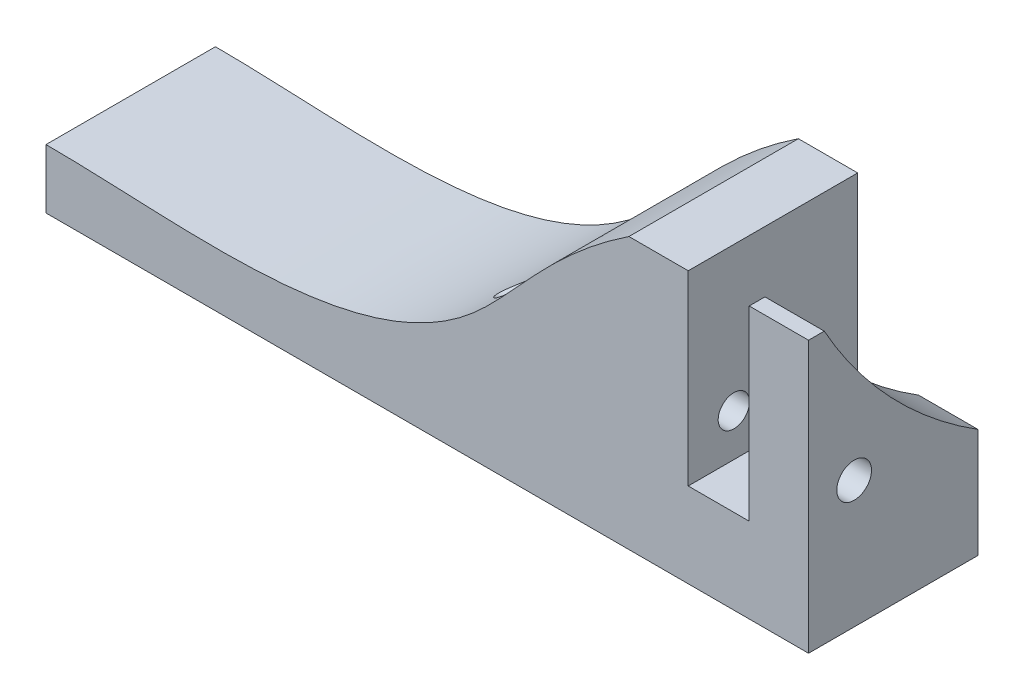
ISO-10303-21;
HEADER;
FILE_DESCRIPTION(('STEP AP214'),'2;1');
FILE_NAME('part.step','',(''),(''),'','','');
FILE_SCHEMA(('AUTOMOTIVE_DESIGN { 1 0 10303 214 1 1 1 1 }'));
ENDSEC;
DATA;
#1=APPLICATION_CONTEXT('core data for automotive mechanical design processes');
#2=APPLICATION_PROTOCOL_DEFINITION('international standard','automotive_design',2000,#1);
#3=PRODUCT_CONTEXT('',#1,'mechanical');
#4=PRODUCT('Part','Part','',(#3));
#5=PRODUCT_RELATED_PRODUCT_CATEGORY('part','',(#4));
#6=PRODUCT_DEFINITION_FORMATION('','',#4);
#7=PRODUCT_DEFINITION_CONTEXT('part definition',#1,'design');
#8=PRODUCT_DEFINITION('design','',#6,#7);
#9=PRODUCT_DEFINITION_SHAPE('','',#8);
#10=(LENGTH_UNIT() NAMED_UNIT(*) SI_UNIT(.MILLI.,.METRE.));
#11=(NAMED_UNIT(*) PLANE_ANGLE_UNIT() SI_UNIT($,.RADIAN.));
#12=(NAMED_UNIT(*) SI_UNIT($,.STERADIAN.) SOLID_ANGLE_UNIT());
#13=UNCERTAINTY_MEASURE_WITH_UNIT(LENGTH_MEASURE(1.E-05),#10,'distance_accuracy_value','');
#14=(GEOMETRIC_REPRESENTATION_CONTEXT(3) GLOBAL_UNCERTAINTY_ASSIGNED_CONTEXT((#13)) GLOBAL_UNIT_ASSIGNED_CONTEXT((#10,
#11,#12)) REPRESENTATION_CONTEXT('',''));
#15=CARTESIAN_POINT('',(0.,0.,0.));
#16=DIRECTION('',(0.,0.,1.));
#17=DIRECTION('',(1.,0.,0.));
#18=AXIS2_PLACEMENT_3D('',#15,#16,#17);
#19=CARTESIAN_POINT('',(7.,130.395512054749,20.));
#20=DIRECTION('',(0.,-1.,0.));
#21=DIRECTION('',(0.,0.,-1.));
#22=AXIS2_PLACEMENT_3D('',#19,#20,#21);
#23=PLANE('',#22);
#24=DIRECTION('',(0.,0.,-1.));
#25=VECTOR('',#24,1.);
#26=CARTESIAN_POINT('',(7.,130.395512054749,20.));
#27=LINE('',#26,#25);
#28=CARTESIAN_POINT('',(7.,130.395512054749,20.));
#29=VERTEX_POINT('',#28);
#30=CARTESIAN_POINT('',(7.,130.395512054749,18.1433906819151));
#31=VERTEX_POINT('',#30);
#32=EDGE_CURVE('E155',#29,#31,#27,.T.);
#33=ORIENTED_EDGE('',*,*,#32,.T.);
#34=DIRECTION('',(1.,0.,0.));
#35=VECTOR('',#34,1.);
#36=CARTESIAN_POINT('',(-157.106637611548,130.395512054749,18.1433906819151));
#37=LINE('',#36,#35);
#38=CARTESIAN_POINT('',(0.,130.395512054749,18.1433906819151));
#39=VERTEX_POINT('',#38);
#40=EDGE_CURVE('E223',#31,#39,#37,.F.);
#41=ORIENTED_EDGE('',*,*,#40,.T.);
#42=DIRECTION('',(0.,0.,-1.));
#43=VECTOR('',#42,1.);
#44=CARTESIAN_POINT('',(0.,130.395512054749,20.));
#45=LINE('',#44,#43);
#46=CARTESIAN_POINT('',(0.,130.395512054749,20.));
#47=VERTEX_POINT('',#46);
#48=EDGE_CURVE('E58',#47,#39,#45,.T.);
#49=ORIENTED_EDGE('',*,*,#48,.F.);
#50=DIRECTION('',(-1.,0.,0.));
#51=VECTOR('',#50,1.);
#52=CARTESIAN_POINT('',(7.,130.395512054749,20.));
#53=LINE('',#52,#51);
#54=EDGE_CURVE('E189',#29,#47,#53,.T.);
#55=ORIENTED_EDGE('',*,*,#54,.F.);
#56=EDGE_LOOP('',(#33,#41,#49,#55));
#57=FACE_BOUND('',#56,.T.);
#58=ADVANCED_FACE('F44',(#57),#23,.F.);
#59=CARTESIAN_POINT('',(0.,130.395512054749,20.));
#60=DIRECTION('',(1.,0.,0.));
#61=DIRECTION('',(0.,1.,0.));
#62=AXIS2_PLACEMENT_3D('',#59,#60,#61);
#63=PLANE('',#62);
#64=CARTESIAN_POINT('',(0.,113.395512054749,14.6157527669362));
#65=DIRECTION('',(1.,0.,0.));
#66=DIRECTION('',(0.,1.,0.));
#67=AXIS2_PLACEMENT_3D('',#64,#65,#66);
#68=CIRCLE('',#67,2.05);
#69=CARTESIAN_POINT('',(0.,115.445512054749,14.6157527669362));
#70=VERTEX_POINT('',#69);
#71=EDGE_CURVE('E163',#70,#70,#68,.T.);
#72=ORIENTED_EDGE('',*,*,#71,.T.);
#73=EDGE_LOOP('',(#72));
#74=FACE_BOUND('',#73,.T.);
#75=ORIENTED_EDGE('',*,*,#48,.T.);
#76=CARTESIAN_POINT('',(0.,156.175472316535,-28.1642074948499));
#77=DIRECTION('',(1.,0.,0.));
#78=DIRECTION('',(0.,1.,0.));
#79=AXIS2_PLACEMENT_3D('',#76,#77,#78);
#80=CIRCLE('',#79,53.);
#81=CARTESIAN_POINT('',(0.,111.27806241143,0.));
#82=VERTEX_POINT('',#81);
#83=EDGE_CURVE('E218',#39,#82,#80,.T.);
#84=ORIENTED_EDGE('',*,*,#83,.T.);
#85=DIRECTION('',(0.,-1.,0.));
#86=VECTOR('',#85,1.);
#87=CARTESIAN_POINT('',(0.,130.395512054749,0.));
#88=LINE('',#87,#86);
#89=CARTESIAN_POINT('',(0.,108.395512054749,0.));
#90=VERTEX_POINT('',#89);
#91=EDGE_CURVE('E159',#82,#90,#88,.T.);
#92=ORIENTED_EDGE('',*,*,#91,.T.);
#93=DIRECTION('',(0.,0.,-1.));
#94=VECTOR('',#93,1.);
#95=CARTESIAN_POINT('',(0.,108.395512054749,20.));
#96=LINE('',#95,#94);
#97=CARTESIAN_POINT('',(0.,108.395512054749,20.));
#98=VERTEX_POINT('',#97);
#99=EDGE_CURVE('E208',#98,#90,#96,.T.);
#100=ORIENTED_EDGE('',*,*,#99,.F.);
#101=DIRECTION('',(0.,-1.,0.));
#102=VECTOR('',#101,1.);
#103=CARTESIAN_POINT('',(0.,130.395512054749,20.));
#104=LINE('',#103,#102);
#105=EDGE_CURVE('E113',#47,#98,#104,.T.);
#106=ORIENTED_EDGE('',*,*,#105,.F.);
#107=EDGE_LOOP('',(#75,#84,#92,#100,#106));
#108=FACE_BOUND('',#107,.T.);
#109=ADVANCED_FACE('F215',(#74,#108),#63,.F.);
#110=CARTESIAN_POINT('',(0.,108.395512054749,20.));
#111=DIRECTION('',(0.,-1.,0.));
#112=DIRECTION('',(0.,0.,-1.));
#113=AXIS2_PLACEMENT_3D('',#110,#111,#112);
#114=PLANE('',#113);
#115=DIRECTION('',(-1.,0.,0.));
#116=VECTOR('',#115,1.);
#117=CARTESIAN_POINT('',(0.,108.395512054749,0.));
#118=LINE('',#117,#116);
#119=CARTESIAN_POINT('',(-7.2,108.395512054749,0.));
#120=VERTEX_POINT('',#119);
#121=EDGE_CURVE('E162',#90,#120,#118,.T.);
#122=ORIENTED_EDGE('',*,*,#121,.T.);
#123=DIRECTION('',(0.,0.,-1.));
#124=VECTOR('',#123,1.);
#125=CARTESIAN_POINT('',(-7.2,108.395512054749,20.));
#126=LINE('',#125,#124);
#127=CARTESIAN_POINT('',(-7.2,108.395512054749,20.));
#128=VERTEX_POINT('',#127);
#129=EDGE_CURVE('E204',#128,#120,#126,.T.);
#130=ORIENTED_EDGE('',*,*,#129,.F.);
#131=DIRECTION('',(-1.,0.,0.));
#132=VECTOR('',#131,1.);
#133=CARTESIAN_POINT('',(0.,108.395512054749,20.));
#134=LINE('',#133,#132);
#135=EDGE_CURVE('E238',#98,#128,#134,.T.);
#136=ORIENTED_EDGE('',*,*,#135,.F.);
#137=ORIENTED_EDGE('',*,*,#99,.T.);
#138=EDGE_LOOP('',(#122,#130,#136,#137));
#139=FACE_BOUND('',#138,.T.);
#140=ADVANCED_FACE('F267',(#139),#114,.F.);
#141=CARTESIAN_POINT('',(-7.2,108.395512054749,20.));
#142=DIRECTION('',(-1.,0.,0.));
#143=DIRECTION('',(0.,-1.,0.));
#144=AXIS2_PLACEMENT_3D('',#141,#142,#143);
#145=PLANE('',#144);
#146=CARTESIAN_POINT('',(-7.2,113.395512054749,14.6157527669362));
#147=DIRECTION('',(-1.,0.,0.));
#148=DIRECTION('',(0.,-1.,0.));
#149=AXIS2_PLACEMENT_3D('',#146,#147,#148);
#150=CIRCLE('',#149,1.85);
#151=CARTESIAN_POINT('',(-7.2,111.545512054749,14.6157527669362));
#152=VERTEX_POINT('',#151);
#153=EDGE_CURVE('E403',#152,#152,#150,.T.);
#154=ORIENTED_EDGE('',*,*,#153,.T.);
#155=EDGE_LOOP('',(#154));
#156=FACE_BOUND('',#155,.T.);
#157=DIRECTION('',(0.,1.,0.));
#158=VECTOR('',#157,1.);
#159=CARTESIAN_POINT('',(-7.2,108.395512054749,0.));
#160=LINE('',#159,#158);
#161=CARTESIAN_POINT('',(-7.2,130.395512054749,0.));
#162=VERTEX_POINT('',#161);
#163=EDGE_CURVE('E166',#120,#162,#160,.T.);
#164=ORIENTED_EDGE('',*,*,#163,.T.);
#165=DIRECTION('',(0.,0.,-1.));
#166=VECTOR('',#165,1.);
#167=CARTESIAN_POINT('',(-7.2,130.395512054749,20.));
#168=LINE('',#167,#166);
#169=CARTESIAN_POINT('',(-7.2,130.395512054749,20.));
#170=VERTEX_POINT('',#169);
#171=EDGE_CURVE('E201',#170,#162,#168,.T.);
#172=ORIENTED_EDGE('',*,*,#171,.F.);
#173=DIRECTION('',(0.,1.,0.));
#174=VECTOR('',#173,1.);
#175=CARTESIAN_POINT('',(-7.2,108.395512054749,20.));
#176=LINE('',#175,#174);
#177=EDGE_CURVE('E241',#128,#170,#176,.T.);
#178=ORIENTED_EDGE('',*,*,#177,.F.);
#179=ORIENTED_EDGE('',*,*,#129,.T.);
#180=EDGE_LOOP('',(#164,#172,#178,#179));
#181=FACE_BOUND('',#180,.T.);
#182=ADVANCED_FACE('F263',(#156,#181),#145,.F.);
#183=CARTESIAN_POINT('',(-7.2,130.395512054749,20.));
#184=DIRECTION('',(0.,-1.,0.));
#185=DIRECTION('',(0.,0.,-1.));
#186=AXIS2_PLACEMENT_3D('',#183,#184,#185);
#187=PLANE('',#186);
#188=DIRECTION('',(-1.,0.,0.));
#189=VECTOR('',#188,1.);
#190=CARTESIAN_POINT('',(-7.2,130.395512054749,0.));
#191=LINE('',#190,#189);
#192=CARTESIAN_POINT('',(-14.2,130.395512054749,0.));
#193=VERTEX_POINT('',#192);
#194=EDGE_CURVE('E170',#162,#193,#191,.T.);
#195=ORIENTED_EDGE('',*,*,#194,.T.);
#196=DIRECTION('',(0.,0.,-1.));
#197=VECTOR('',#196,1.);
#198=CARTESIAN_POINT('',(-14.2,130.395512054749,20.));
#199=LINE('',#198,#197);
#200=CARTESIAN_POINT('',(-14.2,130.395512054749,20.));
#201=VERTEX_POINT('',#200);
#202=EDGE_CURVE('E197',#201,#193,#199,.T.);
#203=ORIENTED_EDGE('',*,*,#202,.F.);
#204=DIRECTION('',(-1.,0.,0.));
#205=VECTOR('',#204,1.);
#206=CARTESIAN_POINT('',(-7.2,130.395512054749,20.));
#207=LINE('',#206,#205);
#208=EDGE_CURVE('E244',#170,#201,#207,.T.);
#209=ORIENTED_EDGE('',*,*,#208,.F.);
#210=ORIENTED_EDGE('',*,*,#171,.T.);
#211=EDGE_LOOP('',(#195,#203,#209,#210));
#212=FACE_BOUND('',#211,.T.);
#213=ADVANCED_FACE('F258',(#212),#187,.F.);
#214=CARTESIAN_POINT('',(-14.2,130.395512054749,20.));
#215=CARTESIAN_POINT('',(-23.5305764736176,124.205565192291,20.));
#216=CARTESIAN_POINT('',(-38.4462109306657,100.318296320815,20.));
#217=CARTESIAN_POINT('',(-66.691471380597,105.395512054749,20.));
#218=CARTESIAN_POINT('',(-83.,105.395512054749,20.));
#219=B_SPLINE_CURVE_WITH_KNOTS('',3,(#214,#215,#216,#217,#218),.UNSPECIFIED.,.F.,.F.,(4,1,4),
(0.,0.267223525795242,1.),.UNSPECIFIED.);
#220=DIRECTION('',(0.,0.,-1.));
#221=VECTOR('',#220,1.);
#222=SURFACE_OF_LINEAR_EXTRUSION('',#219,#221);
#223=CARTESIAN_POINT('',(-32.5828166284044,113.395512054749,12.7657527669362));
#224=CARTESIAN_POINT('',(-32.4985640149264,113.468286739227,12.7657530324167));
#225=CARTESIAN_POINT('',(-32.4147235002987,113.541543087059,12.7700408927074));
#226=CARTESIAN_POINT('',(-32.2483380546385,113.688546064003,12.7876080992605));
#227=CARTESIAN_POINT('',(-32.1657937316529,113.762292901398,12.8008915436178));
#228=CARTESIAN_POINT('',(-32.0026262516761,113.909571085411,12.8369917075661));
#229=CARTESIAN_POINT('',(-31.9220026053751,113.983102482637,12.8598059710376));
#230=CARTESIAN_POINT('',(-31.7634305643206,114.129091067283,12.9156163298347));
#231=CARTESIAN_POINT('',(-31.6854803386932,114.201548969749,12.9486052958528));
#232=CARTESIAN_POINT('',(-31.5171858456044,114.359318813247,13.033601379416));
#233=CARTESIAN_POINT('',(-31.4276485897231,114.444158757142,13.0881403296101));
#234=CARTESIAN_POINT('',(-31.2561073400265,114.608133580243,13.2147706491924));
#235=CARTESIAN_POINT('',(-31.1740910813633,114.687277700838,13.2868327156862));
#236=CARTESIAN_POINT('',(-31.0381729692875,114.819371732612,13.4315078394184));
#237=CARTESIAN_POINT('',(-30.9820999937151,114.874205942849,13.5003392524457));
#238=CARTESIAN_POINT('',(-30.8786980996862,114.975778710841,13.6496378870481));
#239=CARTESIAN_POINT('',(-30.8313578375327,115.022527766119,13.7300897679214));
#240=CARTESIAN_POINT('',(-30.7567427815437,115.096452562343,13.8842917506133));
#241=CARTESIAN_POINT('',(-30.7273437663898,115.125676370606,13.9560233449377));
#242=CARTESIAN_POINT('',(-30.6773611159662,115.175451475547,14.1053660507991));
#243=CARTESIAN_POINT('',(-30.6567716631861,115.19600849532,14.1829732423269));
#244=CARTESIAN_POINT('',(-30.6256887699413,115.227070461522,14.3427152016263));
#245=CARTESIAN_POINT('',(-30.6152604930996,115.237510525606,14.4248756666595));
#246=CARTESIAN_POINT('',(-30.6055852153507,115.247196027481,14.5905048727457));
#247=CARTESIAN_POINT('',(-30.6063338608478,115.246445824066,14.6739730917518));
#248=CARTESIAN_POINT('',(-30.6182744530019,115.234494249625,14.8306438454636));
#249=CARTESIAN_POINT('',(-30.6283830293563,115.224377075495,14.9040183830243));
#250=CARTESIAN_POINT('',(-30.6568606887188,115.195920544503,15.0474689468266));
#251=CARTESIAN_POINT('',(-30.6752307756257,115.1775801884,15.1175445710566));
#252=CARTESIAN_POINT('',(-30.7201133573436,115.132870821357,15.2557328219607));
#253=CARTESIAN_POINT('',(-30.7469259964388,115.106206232873,15.3236504216437));
#254=CARTESIAN_POINT('',(-30.8071223464249,115.046521101447,15.4534784293438));
#255=CARTESIAN_POINT('',(-30.8405096289031,115.013497104056,15.5153855448324));
#256=CARTESIAN_POINT('',(-30.9316585327252,114.923663699589,15.6637148975212));
#257=CARTESIAN_POINT('',(-30.9930026652562,114.863481063715,15.7459003576288));
#258=CARTESIAN_POINT('',(-31.1247942770541,114.735072864963,15.8955380691948));
#259=CARTESIAN_POINT('',(-31.1952681236189,114.666824058494,15.9629460619071));
#260=CARTESIAN_POINT('',(-31.3208846036183,114.546138382563,16.0658748603547));
#261=CARTESIAN_POINT('',(-31.3744164082689,114.494976856637,16.104936040425));
#262=CARTESIAN_POINT('',(-31.4839463132324,114.390926593609,16.1764023673778));
#263=CARTESIAN_POINT('',(-31.5399404033076,114.338040698783,16.2088178833331));
#264=CARTESIAN_POINT('',(-31.7111628426092,114.177381418533,16.2968601799497));
#265=CARTESIAN_POINT('',(-31.8295081211568,114.067725303319,16.3431855442484));
#266=CARTESIAN_POINT('',(-32.0324192530826,113.882526438757,16.4022304533743));
#267=CARTESIAN_POINT('',(-32.1156683403982,113.807302753097,16.4209608604363));
#268=CARTESIAN_POINT('',(-32.2838999691479,113.656943655255,16.4487821223974));
#269=CARTESIAN_POINT('',(-32.3688828824238,113.581808265742,16.4578708868924));
#270=CARTESIAN_POINT('',(-32.5401115790602,113.432179246946,16.4669106109181));
#271=CARTESIAN_POINT('',(-32.6263592159219,113.357686882149,16.4668464577678));
#272=CARTESIAN_POINT('',(-32.7994497803312,113.209928900907,16.4579081497255));
#273=CARTESIAN_POINT('',(-32.8862927425838,113.136663356852,16.4490334768044));
#274=CARTESIAN_POINT('',(-33.0616332473283,112.990452396412,16.4224208954894));
#275=CARTESIAN_POINT('',(-33.1501319849509,112.917537375931,16.4045237571738));
#276=CARTESIAN_POINT('',(-33.3266284764167,112.773819997787,16.3597898766731));
#277=CARTESIAN_POINT('',(-33.4146260991935,112.703018173987,16.3329508959676));
#278=CARTESIAN_POINT('',(-33.5892075606464,112.564166496862,16.2701882763153));
#279=CARTESIAN_POINT('',(-33.675794237751,112.496110562563,16.2342861529805));
#280=CARTESIAN_POINT('',(-33.8468116287397,112.363192584792,16.1529212247358));
#281=CARTESIAN_POINT('',(-33.9312437902163,112.298328368107,16.10746503946));
#282=CARTESIAN_POINT('',(-34.1018830402239,112.168641811441,16.003067855698));
#283=CARTESIAN_POINT('',(-34.1878852837692,112.104062399635,15.9434744118207));
#284=CARTESIAN_POINT('',(-34.3123210087662,112.011608333839,15.8443065281513));
#285=CARTESIAN_POINT('',(-34.3530365098944,111.981527459735,15.8096228011566));
#286=CARTESIAN_POINT('',(-34.4325304101025,111.923096279829,15.7367678064083));
#287=CARTESIAN_POINT('',(-34.4713090073414,111.89474579693,15.6985968965534));
#288=CARTESIAN_POINT('',(-34.5670282174108,111.825104364857,15.5965454916329));
#289=CARTESIAN_POINT('',(-34.6222910600421,111.785224768297,15.5300292111582));
#290=CARTESIAN_POINT('',(-34.6986002674376,111.73049902553,15.4231108980143));
#291=CARTESIAN_POINT('',(-34.7229223213166,111.713117932234,15.3863131119339));
#292=CARTESIAN_POINT('',(-34.7689694182138,111.680305635196,15.3102216243246));
#293=CARTESIAN_POINT('',(-34.7906913677065,111.664876752915,15.2709250332212));
#294=CARTESIAN_POINT('',(-34.839574650446,111.630240930263,15.1725917547669));
#295=CARTESIAN_POINT('',(-34.8651012886249,111.612231576894,15.112287551681));
#296=CARTESIAN_POINT('',(-34.9078931736787,111.582111783727,14.9874850153757));
#297=CARTESIAN_POINT('',(-34.9251742301647,111.569990054524,14.9229949798774));
#298=CARTESIAN_POINT('',(-34.9500231163229,111.552577533234,14.7906172925357));
#299=CARTESIAN_POINT('',(-34.9575055067619,111.547346824905,14.7227050477257));
#300=CARTESIAN_POINT('',(-34.9615886627975,111.544491034894,14.5863961928512));
#301=CARTESIAN_POINT('',(-34.9581929221721,111.546863511264,14.5179997453407));
#302=CARTESIAN_POINT('',(-34.9419548136361,111.558230408256,14.3910531508541));
#303=CARTESIAN_POINT('',(-34.9302468057987,111.566429764308,14.3322770059268));
#304=CARTESIAN_POINT('',(-34.89962433694,111.58793020555,14.2175585590987));
#305=CARTESIAN_POINT('',(-34.8807006062408,111.601237853253,14.1616200076845));
#306=CARTESIAN_POINT('',(-34.8429892816232,111.627845912938,14.0684759825845));
#307=CARTESIAN_POINT('',(-34.8256218241077,111.640123084744,14.0303804924349));
#308=CARTESIAN_POINT('',(-34.7882584938557,111.666605483563,13.9562617615967));
#309=CARTESIAN_POINT('',(-34.7682649902034,111.680808973123,13.9202366946949));
#310=CARTESIAN_POINT('',(-34.7048510387332,111.725992561554,13.8151058306247));
#311=CARTESIAN_POINT('',(-34.6580602531618,111.759501459879,13.749092705894));
#312=CARTESIAN_POINT('',(-34.5692032701337,111.823588774139,13.6386658645723));
#313=CARTESIAN_POINT('',(-34.5283336836863,111.853211408267,13.5926820084909));
#314=CARTESIAN_POINT('',(-34.4436759245531,111.91493007707,13.5052395359997));
#315=CARTESIAN_POINT('',(-34.3998863594669,111.947027292914,13.4637831037207));
#316=CARTESIAN_POINT('',(-34.3100192437898,112.013303234367,13.3850403579927));
#317=CARTESIAN_POINT('',(-34.2639374284164,112.047485868894,13.3477622719889));
#318=CARTESIAN_POINT('',(-34.1700645224087,112.117563010981,13.2771642600061));
#319=CARTESIAN_POINT('',(-34.1222729064617,112.153458045801,13.2438455643211));
#320=CARTESIAN_POINT('',(-33.9973994245415,112.2478640535,13.1627517745736));
#321=CARTESIAN_POINT('',(-33.9193400081545,112.307465409334,13.1177389596643));
#322=CARTESIAN_POINT('',(-33.7610806979254,112.429609126523,13.0362202870158));
#323=CARTESIAN_POINT('',(-33.6808795320667,112.492153253221,12.9997196158943));
#324=CARTESIAN_POINT('',(-33.5192363632258,112.619598467366,12.9348109026917));
#325=CARTESIAN_POINT('',(-33.4377956161659,112.684497250821,12.9063951782324));
#326=CARTESIAN_POINT('',(-33.274247879778,112.816278029024,12.8573649844634));
#327=CARTESIAN_POINT('',(-33.1921411917144,112.883159159762,12.8367471688059));
#328=CARTESIAN_POINT('',(-33.0219578189401,113.023339106134,12.802038228321));
#329=CARTESIAN_POINT('',(-32.9338664064202,113.096758988877,12.7885064431525));
#330=CARTESIAN_POINT('',(-32.7579744331374,113.24511689657,12.7703616360043));
#331=CARTESIAN_POINT('',(-32.6701740153759,113.320055567273,12.7657524916724));
#332=CARTESIAN_POINT('',(-32.5828166284044,113.395512054749,12.7657527669362));
#333=B_SPLINE_CURVE_WITH_KNOTS('',3,(#223,#224,#225,#226,#227,#228,#229,#230,#231,#232,#233,
#234,#235,#236,#237,#238,#239,#240,#241,#242,#243,#244,#245,#246,#247,#248,#249,#250,#251,#252,
#253,#254,#255,#256,#257,#258,#259,#260,#261,#262,#263,#264,#265,#266,#267,#268,#269,#270,#271,
#272,#273,#274,#275,#276,#277,#278,#279,#280,#281,#282,#283,#284,#285,#286,#287,#288,#289,#290,
#291,#292,#293,#294,#295,#296,#297,#298,#299,#300,#301,#302,#303,#304,#305,#306,#307,#308,#309,
#310,#311,#312,#313,#314,#315,#316,#317,#318,#319,#320,#321,#322,#323,#324,#325,#326,#327,#328,
#329,#330,#331,#332),.UNSPECIFIED.,.T.,.F.,(4,2,2,2,2,2,2,2,2,2,2,2,2,2,2,2,2,2,2,2,2,2,2,2,2,2,
2,2,2,2,2,2,2,2,2,2,2,2,2,2,2,2,2,2,2,2,2,2,2,2,2,2,2,2,4),(0.,0.333905739294784,
0.667963697587331,1.001935621242,1.33567406386421,1.73903839875445,2.14173279421798,
2.45370466652765,2.76526839241483,3.01282681208077,3.2602215000285,3.50919248784703,
3.75806649988506,3.98131193929668,4.20458451374999,4.43691668576318,4.66937541904852,
5.02412758061294,5.37992813898949,5.63076007555947,5.88119761540119,6.38265630493339,
6.7235571313365,7.06453185333242,7.4060695763222,7.7476273817779,8.09543588515118,
8.44333152517584,8.79040891370978,9.13724661403968,9.50519838026596,9.68915702783818,
9.87309681642777,10.1577235530796,10.2998096684646,10.4420631878178,10.6450239072927,
10.8475939018935,11.0519186925392,11.2561778658553,11.4368855438472,11.6178261543569,
11.7485440729952,11.8791448643827,12.140841837817,12.3454407201208,12.5501378735169,
12.7552312597372,12.9603882085244,13.284013525996,13.6078355225366,13.931348785418,
14.2547230598114,14.6007831231071,14.9469935452588),.UNSPECIFIED.);
#334=CARTESIAN_POINT('',(-32.5828166284044,113.395512054749,12.7657527669362));
#335=VERTEX_POINT('',#334);
#336=EDGE_CURVE('E47',#335,#335,#333,.T.);
#337=ORIENTED_EDGE('',*,*,#336,.T.);
#338=EDGE_LOOP('',(#337));
#339=FACE_BOUND('',#338,.T.);
#340=CARTESIAN_POINT('',(-14.2,130.395512054749,0.));
#341=CARTESIAN_POINT('',(-23.5305764736176,124.205565192291,0.));
#342=CARTESIAN_POINT('',(-38.4462109306657,100.318296320815,0.));
#343=CARTESIAN_POINT('',(-66.691471380597,105.395512054749,0.));
#344=CARTESIAN_POINT('',(-83.,105.395512054749,0.));
#345=B_SPLINE_CURVE_WITH_KNOTS('',3,(#340,#341,#342,#343,#344),.UNSPECIFIED.,.F.,.F.,(4,1,4),
(0.,0.267223525795242,1.),.UNSPECIFIED.);
#346=CARTESIAN_POINT('',(-83.,105.395512054749,0.));
#347=VERTEX_POINT('',#346);
#348=EDGE_CURVE('E173',#193,#347,#345,.T.);
#349=ORIENTED_EDGE('',*,*,#348,.T.);
#350=DIRECTION('',(0.,0.,-1.));
#351=VECTOR('',#350,1.);
#352=CARTESIAN_POINT('',(-83.,105.395512054749,20.));
#353=LINE('',#352,#351);
#354=CARTESIAN_POINT('',(-83.,105.395512054749,20.));
#355=VERTEX_POINT('',#354);
#356=EDGE_CURVE('E148',#355,#347,#353,.T.);
#357=ORIENTED_EDGE('',*,*,#356,.F.);
#358=EDGE_CURVE('E137',#201,#355,#219,.T.);
#359=ORIENTED_EDGE('',*,*,#358,.F.);
#360=ORIENTED_EDGE('',*,*,#202,.T.);
#361=EDGE_LOOP('',(#349,#357,#359,#360));
#362=FACE_BOUND('',#361,.T.);
#363=ADVANCED_FACE('F253',(#339,#362),#222,.F.);
#364=CARTESIAN_POINT('',(-83.,105.395512054749,20.));
#365=DIRECTION('',(1.,0.,0.));
#366=DIRECTION('',(0.,0.,-1.));
#367=AXIS2_PLACEMENT_3D('',#364,#365,#366);
#368=PLANE('',#367);
#369=DIRECTION('',(0.,-1.,0.));
#370=VECTOR('',#369,1.);
#371=CARTESIAN_POINT('',(-83.,105.395512054749,0.));
#372=LINE('',#371,#370);
#373=CARTESIAN_POINT('',(-83.,98.3955120547487,0.));
#374=VERTEX_POINT('',#373);
#375=EDGE_CURVE('E146',#347,#374,#372,.T.);
#376=ORIENTED_EDGE('',*,*,#375,.T.);
#377=DIRECTION('',(0.,0.,-1.));
#378=VECTOR('',#377,1.);
#379=CARTESIAN_POINT('',(-83.,98.3955120547487,20.));
#380=LINE('',#379,#378);
#381=CARTESIAN_POINT('',(-83.,98.3955120547487,20.));
#382=VERTEX_POINT('',#381);
#383=EDGE_CURVE('E143',#382,#374,#380,.T.);
#384=ORIENTED_EDGE('',*,*,#383,.F.);
#385=DIRECTION('',(0.,-1.,0.));
#386=VECTOR('',#385,1.);
#387=CARTESIAN_POINT('',(-83.,105.395512054749,20.));
#388=LINE('',#387,#386);
#389=EDGE_CURVE('E131',#355,#382,#388,.T.);
#390=ORIENTED_EDGE('',*,*,#389,.F.);
#391=ORIENTED_EDGE('',*,*,#356,.T.);
#392=EDGE_LOOP('',(#376,#384,#390,#391));
#393=FACE_BOUND('',#392,.T.);
#394=ADVANCED_FACE('F144',(#393),#368,.F.);
#395=CARTESIAN_POINT('',(-83.,98.3955120547487,20.));
#396=DIRECTION('',(0.,1.,0.));
#397=DIRECTION('',(0.,0.,1.));
#398=AXIS2_PLACEMENT_3D('',#395,#396,#397);
#399=PLANE('',#398);
#400=DIRECTION('',(1.,0.,0.));
#401=VECTOR('',#400,1.);
#402=CARTESIAN_POINT('',(-83.,98.3955120547487,0.));
#403=LINE('',#402,#401);
#404=CARTESIAN_POINT('',(7.,98.3955120547487,0.));
#405=VERTEX_POINT('',#404);
#406=EDGE_CURVE('E104',#374,#405,#403,.T.);
#407=ORIENTED_EDGE('',*,*,#406,.T.);
#408=DIRECTION('',(0.,0.,-1.));
#409=VECTOR('',#408,1.);
#410=CARTESIAN_POINT('',(7.,98.3955120547487,20.));
#411=LINE('',#410,#409);
#412=CARTESIAN_POINT('',(7.,98.3955120547487,20.));
#413=VERTEX_POINT('',#412);
#414=EDGE_CURVE('E149',#413,#405,#411,.T.);
#415=ORIENTED_EDGE('',*,*,#414,.F.);
#416=DIRECTION('',(1.,0.,0.));
#417=VECTOR('',#416,1.);
#418=CARTESIAN_POINT('',(-83.,98.3955120547487,20.));
#419=LINE('',#418,#417);
#420=EDGE_CURVE('E135',#382,#413,#419,.T.);
#421=ORIENTED_EDGE('',*,*,#420,.F.);
#422=ORIENTED_EDGE('',*,*,#383,.T.);
#423=EDGE_LOOP('',(#407,#415,#421,#422));
#424=FACE_BOUND('',#423,.T.);
#425=ADVANCED_FACE('F151',(#424),#399,.F.);
#426=CARTESIAN_POINT('',(7.,98.3955120547487,20.));
#427=DIRECTION('',(-1.,0.,0.));
#428=DIRECTION('',(0.,0.,1.));
#429=AXIS2_PLACEMENT_3D('',#426,#427,#428);
#430=PLANE('',#429);
#431=CARTESIAN_POINT('',(7.,113.395512054749,14.6157527669362));
#432=DIRECTION('',(1.,0.,0.));
#433=DIRECTION('',(0.,0.,-1.));
#434=AXIS2_PLACEMENT_3D('',#431,#432,#433);
#435=CIRCLE('',#434,2.05);
#436=CARTESIAN_POINT('',(7.,113.395512054749,12.5657527669362));
#437=VERTEX_POINT('',#436);
#438=EDGE_CURVE('E386',#437,#437,#435,.T.);
#439=ORIENTED_EDGE('',*,*,#438,.F.);
#440=EDGE_LOOP('',(#439));
#441=FACE_BOUND('',#440,.T.);
#442=DIRECTION('',(0.,1.,0.));
#443=VECTOR('',#442,1.);
#444=CARTESIAN_POINT('',(7.,98.3955120547487,0.));
#445=LINE('',#444,#443);
#446=CARTESIAN_POINT('',(7.,111.27806241143,0.));
#447=VERTEX_POINT('',#446);
#448=EDGE_CURVE('E185',#405,#447,#445,.T.);
#449=ORIENTED_EDGE('',*,*,#448,.T.);
#450=CARTESIAN_POINT('',(7.,156.175472316535,-28.1642074948499));
#451=DIRECTION('',(1.,0.,0.));
#452=DIRECTION('',(0.,0.,-1.));
#453=AXIS2_PLACEMENT_3D('',#450,#451,#452);
#454=CIRCLE('',#453,53.);
#455=EDGE_CURVE('E64',#31,#447,#454,.T.);
#456=ORIENTED_EDGE('',*,*,#455,.F.);
#457=ORIENTED_EDGE('',*,*,#32,.F.);
#458=DIRECTION('',(0.,1.,0.));
#459=VECTOR('',#458,1.);
#460=CARTESIAN_POINT('',(7.,98.3955120547487,20.));
#461=LINE('',#460,#459);
#462=EDGE_CURVE('E73',#413,#29,#461,.T.);
#463=ORIENTED_EDGE('',*,*,#462,.F.);
#464=ORIENTED_EDGE('',*,*,#414,.T.);
#465=EDGE_LOOP('',(#449,#456,#457,#463,#464));
#466=FACE_BOUND('',#465,.T.);
#467=ADVANCED_FACE('F296',(#441,#466),#430,.F.);
#468=CARTESIAN_POINT('',(-47.1541755314751,106.32177124731,20.));
#469=DIRECTION('',(0.,0.,-1.));
#470=DIRECTION('',(-1.,0.,0.));
#471=AXIS2_PLACEMENT_3D('',#468,#469,#470);
#472=PLANE('',#471);
#473=ORIENTED_EDGE('',*,*,#54,.T.);
#474=ORIENTED_EDGE('',*,*,#105,.T.);
#475=ORIENTED_EDGE('',*,*,#135,.T.);
#476=ORIENTED_EDGE('',*,*,#177,.T.);
#477=ORIENTED_EDGE('',*,*,#208,.T.);
#478=ORIENTED_EDGE('',*,*,#358,.T.);
#479=ORIENTED_EDGE('',*,*,#389,.T.);
#480=ORIENTED_EDGE('',*,*,#420,.T.);
#481=ORIENTED_EDGE('',*,*,#462,.T.);
#482=EDGE_LOOP('',(#473,#474,#475,#476,#477,#478,#479,#480,#481));
#483=FACE_BOUND('',#482,.T.);
#484=ADVANCED_FACE('F133',(#483),#472,.F.);
#485=CARTESIAN_POINT('',(-47.1541755314751,106.32177124731,0.));
#486=DIRECTION('',(0.,0.,-1.));
#487=DIRECTION('',(-1.,0.,0.));
#488=AXIS2_PLACEMENT_3D('',#485,#486,#487);
#489=PLANE('',#488);
#490=DIRECTION('',(1.,0.,0.));
#491=VECTOR('',#490,1.);
#492=CARTESIAN_POINT('',(-157.106637611548,111.27806241143,0.));
#493=LINE('',#492,#491);
#494=EDGE_CURVE('E11',#447,#82,#493,.F.);
#495=ORIENTED_EDGE('',*,*,#494,.F.);
#496=ORIENTED_EDGE('',*,*,#448,.F.);
#497=ORIENTED_EDGE('',*,*,#406,.F.);
#498=ORIENTED_EDGE('',*,*,#375,.F.);
#499=ORIENTED_EDGE('',*,*,#348,.F.);
#500=ORIENTED_EDGE('',*,*,#194,.F.);
#501=ORIENTED_EDGE('',*,*,#163,.F.);
#502=ORIENTED_EDGE('',*,*,#121,.F.);
#503=ORIENTED_EDGE('',*,*,#91,.F.);
#504=EDGE_LOOP('',(#495,#496,#497,#498,#499,#500,#501,#502,#503));
#505=FACE_BOUND('',#504,.T.);
#506=ADVANCED_FACE('F289',(#505),#489,.T.);
#507=CARTESIAN_POINT('',(-157.106637611548,156.175472316535,-28.1642074948499));
#508=DIRECTION('',(1.,0.,0.));
#509=DIRECTION('',(0.,0.,-1.));
#510=AXIS2_PLACEMENT_3D('',#507,#508,#509);
#511=CYLINDRICAL_SURFACE('',#510,53.);
#512=ORIENTED_EDGE('',*,*,#455,.T.);
#513=ORIENTED_EDGE('',*,*,#494,.T.);
#514=ORIENTED_EDGE('',*,*,#83,.F.);
#515=ORIENTED_EDGE('',*,*,#40,.F.);
#516=EDGE_LOOP('',(#512,#513,#514,#515));
#517=FACE_BOUND('',#516,.T.);
#518=ADVANCED_FACE('F281',(#517),#511,.F.);
#519=CARTESIAN_POINT('',(-157.106637611548,113.395512054749,14.6157527669362));
#520=DIRECTION('',(1.,0.,0.));
#521=DIRECTION('',(0.,0.,-1.));
#522=AXIS2_PLACEMENT_3D('',#519,#520,#521);
#523=CYLINDRICAL_SURFACE('',#522,2.05);
#524=ORIENTED_EDGE('',*,*,#438,.T.);
#525=EDGE_LOOP('',(#524));
#526=FACE_BOUND('',#525,.T.);
#527=ORIENTED_EDGE('',*,*,#71,.F.);
#528=EDGE_LOOP('',(#527));
#529=FACE_BOUND('',#528,.T.);
#530=ADVANCED_FACE('F278',(#526,#529),#523,.F.);
#531=CARTESIAN_POINT('',(-49.,113.395512054749,14.6157527669362));
#532=DIRECTION('',(1.,0.,0.));
#533=DIRECTION('',(0.,0.,-1.));
#534=AXIS2_PLACEMENT_3D('',#531,#532,#533);
#535=CYLINDRICAL_SURFACE('',#534,1.85);
#536=ORIENTED_EDGE('',*,*,#336,.F.);
#537=EDGE_LOOP('',(#536));
#538=FACE_BOUND('',#537,.T.);
#539=ORIENTED_EDGE('',*,*,#153,.F.);
#540=EDGE_LOOP('',(#539));
#541=FACE_BOUND('',#540,.T.);
#542=ADVANCED_FACE('F280',(#538,#541),#535,.F.);
#543=CLOSED_SHELL('',(#58,#109,#140,#182,#213,#363,#394,#425,#467,#484,#506,#518,#530,#542));
#544=MANIFOLD_SOLID_BREP('B2',#543);
#545=ADVANCED_BREP_SHAPE_REPRESENTATION('',(#18,#544),#14);
#546=SHAPE_DEFINITION_REPRESENTATION(#9,#545);
ENDSEC;
END-ISO-10303-21;
